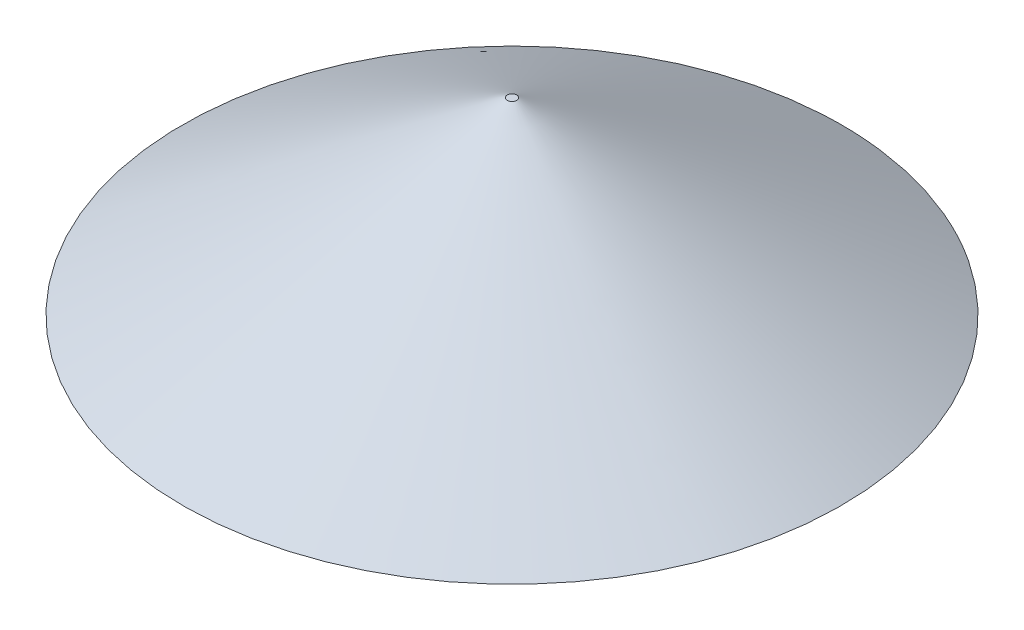
ISO-10303-21;
HEADER;
FILE_DESCRIPTION(('STEP AP214'),'2;1');
FILE_NAME('part.step','',(''),(''),'','','');
FILE_SCHEMA(('AUTOMOTIVE_DESIGN { 1 0 10303 214 1 1 1 1 }'));
ENDSEC;
DATA;
#1=APPLICATION_CONTEXT('core data for automotive mechanical design processes');
#2=APPLICATION_PROTOCOL_DEFINITION('international standard','automotive_design',2000,#1);
#3=PRODUCT_CONTEXT('',#1,'mechanical');
#4=PRODUCT('Part','Part','',(#3));
#5=PRODUCT_RELATED_PRODUCT_CATEGORY('part','',(#4));
#6=PRODUCT_DEFINITION_FORMATION('','',#4);
#7=PRODUCT_DEFINITION_CONTEXT('part definition',#1,'design');
#8=PRODUCT_DEFINITION('design','',#6,#7);
#9=PRODUCT_DEFINITION_SHAPE('','',#8);
#10=(LENGTH_UNIT() NAMED_UNIT(*) SI_UNIT(.MILLI.,.METRE.));
#11=(NAMED_UNIT(*) PLANE_ANGLE_UNIT() SI_UNIT($,.RADIAN.));
#12=(NAMED_UNIT(*) SI_UNIT($,.STERADIAN.) SOLID_ANGLE_UNIT());
#13=UNCERTAINTY_MEASURE_WITH_UNIT(LENGTH_MEASURE(1.E-05),#10,'distance_accuracy_value','');
#14=(GEOMETRIC_REPRESENTATION_CONTEXT(3) GLOBAL_UNCERTAINTY_ASSIGNED_CONTEXT((#13)) GLOBAL_UNIT_ASSIGNED_CONTEXT((#10,
#11,#12)) REPRESENTATION_CONTEXT('',''));
#15=CARTESIAN_POINT('',(0.,0.,0.));
#16=DIRECTION('',(0.,0.,1.));
#17=DIRECTION('',(1.,0.,0.));
#18=AXIS2_PLACEMENT_3D('',#15,#16,#17);
#19=CARTESIAN_POINT('',(0.,20.,0.));
#20=DIRECTION('',(0.,1.,0.));
#21=DIRECTION('',(0.,0.,1.));
#22=AXIS2_PLACEMENT_3D('',#19,#20,#21);
#23=PLANE('',#22);
#24=CARTESIAN_POINT('',(0.,20.,0.));
#25=DIRECTION('',(0.,1.,0.));
#26=DIRECTION('',(0.,0.,1.));
#27=AXIS2_PLACEMENT_3D('',#24,#25,#26);
#28=CIRCLE('',#27,0.5);
#29=CARTESIAN_POINT('',(0.,20.,0.5));
#30=VERTEX_POINT('',#29);
#31=EDGE_CURVE('E11',#30,#30,#28,.T.);
#32=ORIENTED_EDGE('',*,*,#31,.T.);
#33=EDGE_LOOP('',(#32));
#34=FACE_BOUND('',#33,.T.);
#35=ADVANCED_FACE('F43',(#34),#23,.T.);
#36=CARTESIAN_POINT('',(0.,0.,0.));
#37=DIRECTION('',(0.,1.,0.));
#38=DIRECTION('',(0.,0.,1.));
#39=AXIS2_PLACEMENT_3D('',#36,#37,#38);
#40=PLANE('',#39);
#41=CARTESIAN_POINT('',(0.,0.,0.));
#42=DIRECTION('',(0.,1.,0.));
#43=DIRECTION('',(0.,0.,1.));
#44=AXIS2_PLACEMENT_3D('',#41,#42,#43);
#45=CIRCLE('',#44,35.);
#46=CARTESIAN_POINT('',(-9.06814161122873,0.,33.8048636695772));
#47=VERTEX_POINT('',#46);
#48=EDGE_CURVE('E52',#47,#47,#45,.T.);
#49=ORIENTED_EDGE('',*,*,#48,.F.);
#50=EDGE_LOOP('',(#49));
#51=FACE_BOUND('',#50,.T.);
#52=ADVANCED_FACE('F76',(#51),#40,.F.);
#53=CARTESIAN_POINT('',(-9.06814161122873,0.,33.8048636695772));
#54=CARTESIAN_POINT('',(0.,20.,0.5));
#55=CARTESIAN_POINT('',(58.5415857279257,0.,51.9411468920347));
#56=CARTESIAN_POINT('',(1.,20.,0.5));
#57=CARTESIAN_POINT('',(76.6778689503831,0.,-15.6685804471197));
#58=CARTESIAN_POINT('',(1.,20.,-0.5));
#59=CARTESIAN_POINT('',(9.06814161122875,0.,-33.8048636695772));
#60=CARTESIAN_POINT('',(0.,20.,-0.5));
#61=CARTESIAN_POINT('',(-58.5415857279257,0.,-51.9411468920347));
#62=CARTESIAN_POINT('',(-1.,20.,-0.5));
#63=CARTESIAN_POINT('',(-76.6778689503832,0.,15.6685804471197));
#64=CARTESIAN_POINT('',(-1.,20.,0.5));
#65=CARTESIAN_POINT('',(-9.06814161122873,0.,33.8048636695772));
#66=CARTESIAN_POINT('',(0.,20.,0.5));
#67=(BOUNDED_SURFACE() B_SPLINE_SURFACE(3,1,((#53,#54),(#55,#56),(#57,#58),(#59,#60),(#61,#62),
(#63,#64),(#65,#66)),.UNSPECIFIED.,.T.,.F.,.F.) B_SPLINE_SURFACE_WITH_KNOTS((4,3,4),(2,2),(0.,
0.5,1.),(0.,1.),.UNSPECIFIED.) GEOMETRIC_REPRESENTATION_ITEM() RATIONAL_B_SPLINE_SURFACE(((1.,
1.),(0.333333333333334,0.333333333333333),(0.333333333333334,0.333333333333333),(1.,1.),
(0.333333333333333,0.333333333333333),(0.333333333333333,0.333333333333333),(1.,1.))) REPRESENTATION_ITEM('') SURFACE());
#68=CARTESIAN_POINT('',(-9.06814161122873,0.,33.8048636695772));
#69=CARTESIAN_POINT('',(-8.97368180277843,0.208333333333335,33.4579380063525));
#70=CARTESIAN_POINT('',(-8.87922199432813,0.416666666666668,33.1110123431277));
#71=CARTESIAN_POINT('',(-8.69030237742753,0.833333333333333,32.4171610166782));
#72=CARTESIAN_POINT('',(-8.59584256897723,1.04166666666667,32.0702353534534));
#73=CARTESIAN_POINT('',(-8.40692295207663,1.45833333333333,31.3763840270039));
#74=CARTESIAN_POINT('',(-8.31246314362633,1.66666666666667,31.0294583637791));
#75=CARTESIAN_POINT('',(-8.12354352672573,2.08333333333333,30.3356070373296));
#76=CARTESIAN_POINT('',(-8.02908371827544,2.29166666666667,29.9886813741048));
#77=CARTESIAN_POINT('',(-7.84016410137484,2.70833333333333,29.2948300476553));
#78=CARTESIAN_POINT('',(-7.74570429292454,2.91666666666667,28.9479043844306));
#79=CARTESIAN_POINT('',(-7.55678467602394,3.33333333333333,28.254053057981));
#80=CARTESIAN_POINT('',(-7.46232486757364,3.54166666666667,27.9071273947563));
#81=CARTESIAN_POINT('',(-7.27340525067304,3.95833333333333,27.2132760683067));
#82=CARTESIAN_POINT('',(-7.17894544222274,4.16666666666667,26.866350405082));
#83=CARTESIAN_POINT('',(-6.99002582532214,4.58333333333333,26.1724990786324));
#84=CARTESIAN_POINT('',(-6.89556601687184,4.79166666666667,25.8255734154077));
#85=CARTESIAN_POINT('',(-6.70664639997125,5.20833333333333,25.1317220889582));
#86=CARTESIAN_POINT('',(-6.61218659152095,5.41666666666667,24.7847964257334));
#87=CARTESIAN_POINT('',(-6.42326697462035,5.83333333333333,24.0909450992839));
#88=CARTESIAN_POINT('',(-6.32880716617005,6.04166666666667,23.7440194360591));
#89=CARTESIAN_POINT('',(-6.13988754926945,6.45833333333333,23.0501681096096));
#90=CARTESIAN_POINT('',(-6.04542774081915,6.66666666666667,22.7032424463848));
#91=CARTESIAN_POINT('',(-5.85650812391855,7.08333333333333,22.0093911199353));
#92=CARTESIAN_POINT('',(-5.76204831546825,7.29166666666667,21.6624654567105));
#93=CARTESIAN_POINT('',(-5.57312869856765,7.70833333333333,20.968614130261));
#94=CARTESIAN_POINT('',(-5.47866889011736,7.91666666666667,20.6216884670362));
#95=CARTESIAN_POINT('',(-5.28974927321676,8.33333333333333,19.9278371405867));
#96=CARTESIAN_POINT('',(-5.19528946476646,8.54166666666667,19.580911477362));
#97=CARTESIAN_POINT('',(-5.00636984786586,8.95833333333333,18.8870601509124));
#98=CARTESIAN_POINT('',(-4.91191003941556,9.16666666666667,18.5401344876877));
#99=CARTESIAN_POINT('',(-4.72299042251496,9.58333333333333,17.8462831612381));
#100=CARTESIAN_POINT('',(-4.62853061406466,9.79166666666667,17.4993574980134));
#101=CARTESIAN_POINT('',(-4.43961099716406,10.2083333333333,16.8055061715639));
#102=CARTESIAN_POINT('',(-4.34515118871377,10.4166666666667,16.4585805083391));
#103=CARTESIAN_POINT('',(-4.15623157181317,10.8333333333333,15.7647291818896));
#104=CARTESIAN_POINT('',(-4.06177176336287,11.0416666666667,15.4178035186648));
#105=CARTESIAN_POINT('',(-3.87285214646227,11.4583333333333,14.7239521922153));
#106=CARTESIAN_POINT('',(-3.77839233801197,11.6666666666667,14.3770265289905));
#107=CARTESIAN_POINT('',(-3.58947272111137,12.0833333333333,13.683175202541));
#108=CARTESIAN_POINT('',(-3.49501291266107,12.2916666666667,13.3362495393162));
#109=CARTESIAN_POINT('',(-3.30609329576047,12.7083333333333,12.6423982128667));
#110=CARTESIAN_POINT('',(-3.21163348731017,12.9166666666667,12.2954725496419));
#111=CARTESIAN_POINT('',(-3.02271387040958,13.3333333333333,11.6016212231924));
#112=CARTESIAN_POINT('',(-2.92825406195928,13.5416666666667,11.2546955599676));
#113=CARTESIAN_POINT('',(-2.73933444505868,13.9583333333333,10.5608442335181));
#114=CARTESIAN_POINT('',(-2.64487463660838,14.1666666666667,10.2139185702934));
#115=CARTESIAN_POINT('',(-2.45595501970778,14.5833333333333,9.52006724384383));
#116=CARTESIAN_POINT('',(-2.36149521125748,14.7916666666667,9.17314158061907));
#117=CARTESIAN_POINT('',(-2.17257559435688,15.2083333333333,8.47929025416954));
#118=CARTESIAN_POINT('',(-2.07811578590658,15.4166666666667,8.13236459094478));
#119=CARTESIAN_POINT('',(-1.88919616900599,15.8333333333333,7.43851326449526));
#120=CARTESIAN_POINT('',(-1.79473636055569,16.0416666666667,7.09158760127049));
#121=CARTESIAN_POINT('',(-1.60581674365509,16.4583333333333,6.39773627482097));
#122=CARTESIAN_POINT('',(-1.51135693520479,16.6666666666667,6.05081061159621));
#123=CARTESIAN_POINT('',(-1.32243731830419,17.0833333333333,5.35695928514668));
#124=CARTESIAN_POINT('',(-1.22797750985389,17.2916666666667,5.01003362192192));
#125=CARTESIAN_POINT('',(-1.03905789295329,17.7083333333333,4.31618229547239));
#126=CARTESIAN_POINT('',(-0.944598084502992,17.9166666666667,3.96925663224763));
#127=CARTESIAN_POINT('',(-0.755678467602394,18.3333333333333,3.2754053057981));
#128=CARTESIAN_POINT('',(-0.661218659152095,18.5416666666667,2.92847964257334));
#129=CARTESIAN_POINT('',(-0.472299042251496,18.9583333333333,2.23462831612381));
#130=CARTESIAN_POINT('',(-0.377839233801197,19.1666666666667,1.88770265289905));
#131=CARTESIAN_POINT('',(-0.188919616900598,19.5833333333333,1.19385132644953));
#132=CARTESIAN_POINT('',(-0.0944598084502992,19.7916666666667,0.846925663224763));
#133=CARTESIAN_POINT('',(0.,20.,0.5));
#134=B_SPLINE_CURVE_WITH_KNOTS('',3,(#68,#69,#70,#71,#72,#73,#74,#75,#76,#77,#78,#79,#80,#81,
#82,#83,#84,#85,#86,#87,#88,#89,#90,#91,#92,#93,#94,#95,#96,#97,#98,#99,#100,#101,#102,#103,
#104,#105,#106,#107,#108,#109,#110,#111,#112,#113,#114,#115,#116,#117,#118,#119,#120,#121,#122,
#123,#124,#125,#126,#127,#128,#129,#130,#131,#132,#133),.UNSPECIFIED.,.F.,.F.,(4,2,2,2,2,2,2,2,
2,2,2,2,2,2,2,2,2,2,2,2,2,2,2,2,2,2,2,2,2,2,2,2,4),(0.,1.24665377749705,2.49330755499412,
3.73996133249117,4.98661510998823,6.23326888748528,7.47992266498234,8.72657644247939,
9.97323021997645,11.2198839974735,12.4665377749706,13.7131915524676,14.9598453299647,
16.2064991074617,17.4531528849588,18.6998066624558,19.9464604399529,21.19311421745,
22.439767994947,23.6864217724441,24.9330755499411,26.1797293274382,27.4263831049352,
28.6730368824323,29.9196906599293,31.1663444374264,32.4129982149235,33.6596519924205,
34.9063057699176,36.1529595474146,37.3996133249117,38.6462671024087,39.8929208799058),.UNSPECIFIED.);
#135=EDGE_CURVE('BSEAM84',#47,#30,#134,.T.);
#136=ORIENTED_EDGE('',*,*,#48,.T.);
#137=ORIENTED_EDGE('',*,*,#31,.F.);
#138=ORIENTED_EDGE('',*,*,#135,.T.);
#139=ORIENTED_EDGE('',*,*,#135,.F.);
#140=EDGE_LOOP('',(#136,#138,#137,#139));
#141=FACE_BOUND('',#140,.T.);
#142=ADVANCED_FACE('F84',(#141),#67,.T.);
#143=CLOSED_SHELL('',(#35,#52,#142));
#144=MANIFOLD_SOLID_BREP('B2',#143);
#145=ADVANCED_BREP_SHAPE_REPRESENTATION('',(#18,#144),#14);
#146=SHAPE_DEFINITION_REPRESENTATION(#9,#145);
ENDSEC;
END-ISO-10303-21;
